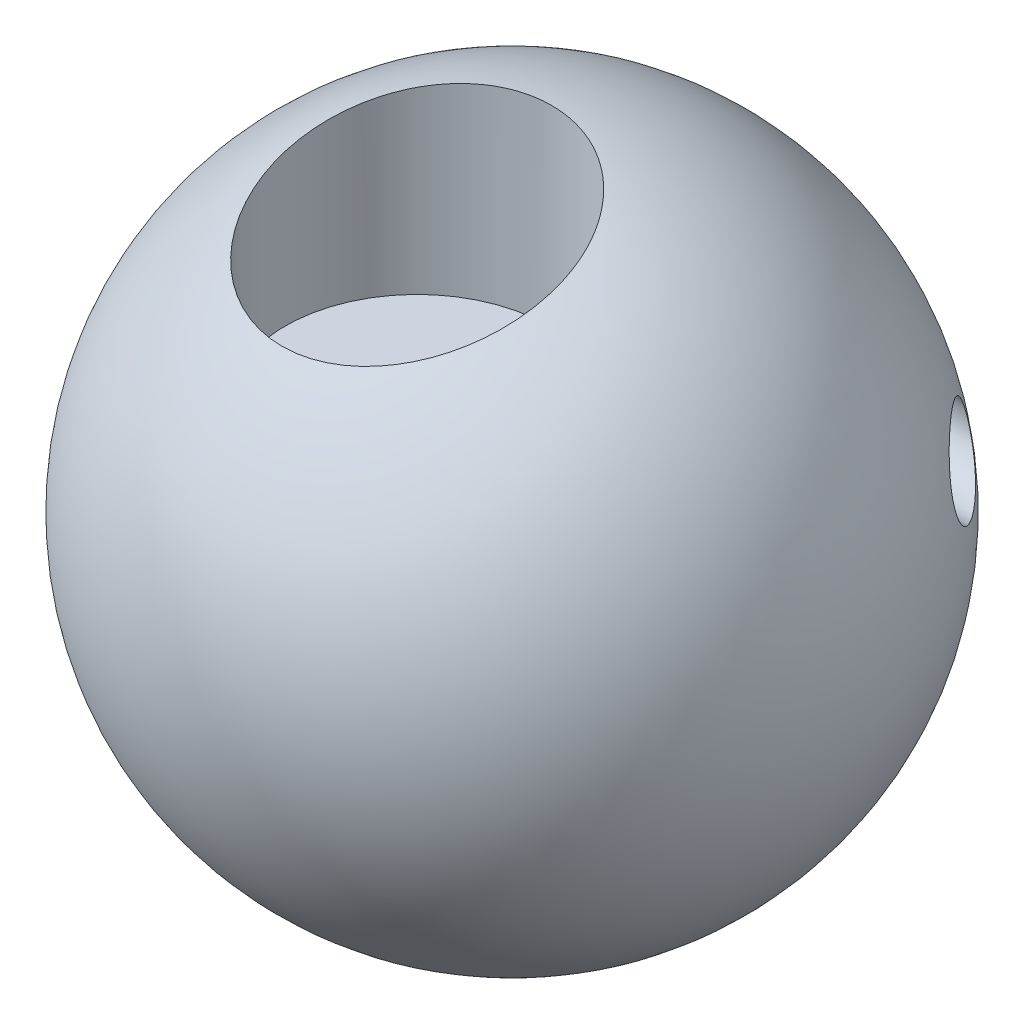
ISO-10303-21;
HEADER;
FILE_DESCRIPTION(('STEP AP214'),'2;1');
FILE_NAME('part.step','',(''),(''),'','','');
FILE_SCHEMA(('AUTOMOTIVE_DESIGN { 1 0 10303 214 1 1 1 1 }'));
ENDSEC;
DATA;
#1=APPLICATION_CONTEXT('core data for automotive mechanical design processes');
#2=APPLICATION_PROTOCOL_DEFINITION('international standard','automotive_design',2000,#1);
#3=PRODUCT_CONTEXT('',#1,'mechanical');
#4=PRODUCT('Part','Part','',(#3));
#5=PRODUCT_RELATED_PRODUCT_CATEGORY('part','',(#4));
#6=PRODUCT_DEFINITION_FORMATION('','',#4);
#7=PRODUCT_DEFINITION_CONTEXT('part definition',#1,'design');
#8=PRODUCT_DEFINITION('design','',#6,#7);
#9=PRODUCT_DEFINITION_SHAPE('','',#8);
#10=(LENGTH_UNIT() NAMED_UNIT(*) SI_UNIT(.MILLI.,.METRE.));
#11=(NAMED_UNIT(*) PLANE_ANGLE_UNIT() SI_UNIT($,.RADIAN.));
#12=(NAMED_UNIT(*) SI_UNIT($,.STERADIAN.) SOLID_ANGLE_UNIT());
#13=UNCERTAINTY_MEASURE_WITH_UNIT(LENGTH_MEASURE(1.E-05),#10,'distance_accuracy_value','');
#14=(GEOMETRIC_REPRESENTATION_CONTEXT(3) GLOBAL_UNCERTAINTY_ASSIGNED_CONTEXT((#13)) GLOBAL_UNIT_ASSIGNED_CONTEXT((#10,
#11,#12)) REPRESENTATION_CONTEXT('',''));
#15=CARTESIAN_POINT('',(0.,0.,0.));
#16=DIRECTION('',(0.,0.,1.));
#17=DIRECTION('',(1.,0.,0.));
#18=AXIS2_PLACEMENT_3D('',#15,#16,#17);
#19=CARTESIAN_POINT('',(0.,0.,0.));
#20=DIRECTION('',(0.,1.,0.));
#21=DIRECTION('',(0.,0.,1.));
#22=AXIS2_PLACEMENT_3D('',#19,#20,#21);
#23=TOROIDAL_SURFACE('',#22,72.1322546619376,9.84462162920429);
#24=CARTESIAN_POINT('',(0.,0.,81.9768762911419));
#25=VERTEX_POINT('',#24);
#26=VERTEX_LOOP('',#25);
#27=FACE_BOUND('',#26,.T.);
#28=ADVANCED_FACE('F43',(#27),#23,.T.);
#29=CLOSED_SHELL('',(#28));
#30=MANIFOLD_SOLID_BREP('B2',#29);
#31=CARTESIAN_POINT('',(0.,0.,0.));
#32=DIRECTION('',(0.,1.,0.));
#33=DIRECTION('',(1.,0.,0.));
#34=AXIS2_PLACEMENT_3D('',#31,#32,#33);
#35=SPHERICAL_SURFACE('',#34,100.);
#36=CARTESIAN_POINT('',(-76.7585668328231,4.82017874367396,-63.9131308468774));
#37=CARTESIAN_POINT('',(-77.0812542326004,4.72252799396046,-63.5329531939064));
#38=CARTESIAN_POINT('',(-77.4026196833159,4.6431210983936,-63.1469248083177));
#39=CARTESIAN_POINT('',(-78.0409807790761,4.52232743059165,-62.3651528120796));
#40=CARTESIAN_POINT('',(-78.3579747869562,4.48095454108507,-61.9694057080889));
#41=CARTESIAN_POINT('',(-78.9858586337921,4.4380383859875,-61.1702290564147));
#42=CARTESIAN_POINT('',(-79.2967415488923,4.43653795886195,-60.7667917119222));
#43=CARTESIAN_POINT('',(-79.9098202207956,4.47548974829651,-59.9553953610056));
#44=CARTESIAN_POINT('',(-80.2120179533117,4.51593234473524,-59.5474374126623));
#45=CARTESIAN_POINT('',(-80.7499644418729,4.62927073533002,-58.8063307602071));
#46=CARTESIAN_POINT('',(-80.9876032998101,4.69471605000407,-58.4734056384661));
#47=CARTESIAN_POINT('',(-81.4539887358628,4.85602427409244,-57.8086331129365));
#48=CARTESIAN_POINT('',(-81.6827355365148,4.95188642173106,-57.476785682368));
#49=CARTESIAN_POINT('',(-82.1292880901065,5.1750663078504,-56.8169838068717));
#50=CARTESIAN_POINT('',(-82.3471083370449,5.30234097487506,-56.489024670473));
#51=CARTESIAN_POINT('',(-82.7701648239548,5.58949632366565,-55.8393065027775));
#52=CARTESIAN_POINT('',(-82.9754034385343,5.74937082787029,-55.5175463094261));
#53=CARTESIAN_POINT('',(-83.3338228112824,6.06930337188106,-54.9431536783846));
#54=CARTESIAN_POINT('',(-83.4895289414374,6.2236582006722,-54.6889130988375));
#55=CARTESIAN_POINT('',(-83.7898914589301,6.55467953561914,-54.1885850136802));
#56=CARTESIAN_POINT('',(-83.93455008487,6.73134150223173,-53.9424958620656));
#57=CARTESIAN_POINT('',(-84.2114551823971,7.10706393976069,-53.4605741484614));
#58=CARTESIAN_POINT('',(-84.3437009908441,7.30612560610679,-53.2247421348079));
#59=CARTESIAN_POINT('',(-84.5943065205733,7.72638816754377,-52.7656968100389));
#60=CARTESIAN_POINT('',(-84.7126660000598,7.94758944801621,-52.5424837186852));
#61=CARTESIAN_POINT('',(-84.9349304397547,8.41343321648644,-52.1093675190535));
#62=CARTESIAN_POINT('',(-85.0387046906843,8.65825812895282,-51.8995929400164));
#63=CARTESIAN_POINT('',(-85.2290903626374,9.16857972366849,-51.4980947510638));
#64=CARTESIAN_POINT('',(-85.3157014202906,9.43407684341327,-51.3063715233672));
#65=CARTESIAN_POINT('',(-85.4702945392384,9.98375626437071,-50.9437695111752));
#66=CARTESIAN_POINT('',(-85.5382919670269,10.2679229111315,-50.7728735977416));
#67=CARTESIAN_POINT('',(-85.6545557621558,10.8527753363836,-50.4542225375767));
#68=CARTESIAN_POINT('',(-85.7028256594871,11.1534581485839,-50.3064632537611));
#69=CARTESIAN_POINT('',(-85.773368335255,11.7246710449301,-50.0554239194716));
#70=CARTESIAN_POINT('',(-85.7983622720361,11.9934068655407,-49.9488066537456));
#71=CARTESIAN_POINT('',(-85.8328795469118,12.5388085142815,-49.7551914619391));
#72=CARTESIAN_POINT('',(-85.8424045768517,12.8154734718278,-49.6681913912086));
#73=CARTESIAN_POINT('',(-85.845888866495,13.3744002837037,-49.5145712602885));
#74=CARTESIAN_POINT('',(-85.8398529908095,13.656660361526,-49.4479448382245));
#75=CARTESIAN_POINT('',(-85.8123671475474,14.2245369230569,-49.3354250150657));
#76=CARTESIAN_POINT('',(-85.7909173506711,14.5101533695612,-49.2895313843761));
#77=CARTESIAN_POINT('',(-85.7348186899926,15.0641874445222,-49.2207755880758));
#78=CARTESIAN_POINT('',(-85.7010972183411,15.3325422064348,-49.196632998778));
#79=CARTESIAN_POINT('',(-85.6209232865895,15.8683378797072,-49.166319234069));
#80=CARTESIAN_POINT('',(-85.5744715857874,16.1357788446078,-49.1601469870667));
#81=CARTESIAN_POINT('',(-85.4694195122994,16.6680434738668,-49.1653154321832));
#82=CARTESIAN_POINT('',(-85.4108205651903,16.9328674415333,-49.1766540702652));
#83=CARTESIAN_POINT('',(-85.2821142121608,17.4585131195855,-49.2162062409356));
#84=CARTESIAN_POINT('',(-85.2120024365936,17.7193332690782,-49.2444261915471));
#85=CARTESIAN_POINT('',(-85.056204966307,18.2519675724241,-49.3192758528517));
#86=CARTESIAN_POINT('',(-84.9698124166467,18.5234260944663,-49.3669621710898));
#87=CARTESIAN_POINT('',(-84.785721284316,19.0589287495074,-49.4795116269701));
#88=CARTESIAN_POINT('',(-84.6880186211544,19.3229701635823,-49.5443809748905));
#89=CARTESIAN_POINT('',(-84.4822340907378,19.842448323463,-49.6901674056054));
#90=CARTESIAN_POINT('',(-84.3741512138798,20.0978842290074,-49.7710860502079));
#91=CARTESIAN_POINT('',(-84.1484993070822,20.5992467783899,-49.947817820461));
#92=CARTESIAN_POINT('',(-84.0309289995845,20.8451721349392,-50.043632953658));
#93=CARTESIAN_POINT('',(-83.7683424693129,21.3639667950834,-50.2648664907342));
#94=CARTESIAN_POINT('',(-83.6218907267268,21.6351372562857,-50.3925714664217));
#95=CARTESIAN_POINT('',(-83.3187511789622,22.162993529281,-50.6645698934378));
#96=CARTESIAN_POINT('',(-83.1620623762108,22.4196779248913,-50.8088649624687));
#97=CARTESIAN_POINT('',(-82.6782620072172,23.167258901753,-51.2642890902127));
#98=CARTESIAN_POINT('',(-82.3373882626456,23.6357383771593,-51.5979811023742));
#99=CARTESIAN_POINT('',(-81.5543012577302,24.5995187257649,-52.3870792199402));
#100=CARTESIAN_POINT('',(-81.1056459924542,25.0805984419682,-52.8534104010666));
#101=CARTESIAN_POINT('',(-80.4104965678629,25.7326036170072,-53.5924189464678));
#102=CARTESIAN_POINT('',(-80.1749460822205,25.938433015958,-53.8454948507388));
#103=CARTESIAN_POINT('',(-79.6975437852534,26.3269790540179,-54.3631632351158));
#104=CARTESIAN_POINT('',(-79.4556916993139,26.5096946838236,-54.6277562174575));
#105=CARTESIAN_POINT('',(-78.6194372946881,27.0951866123555,-55.5498013216608));
#106=CARTESIAN_POINT('',(-78.0118016829368,27.4422738338175,-56.2318911508049));
#107=CARTESIAN_POINT('',(-77.0882381734649,27.8615708941092,-57.283289207045));
#108=CARTESIAN_POINT('',(-76.7781043559441,27.9845071238218,-57.6387708566343));
#109=CARTESIAN_POINT('',(-76.155047551259,28.1966200979121,-58.3574876683824));
#110=CARTESIAN_POINT('',(-75.8421244833,28.2857958610939,-58.7207230555675));
#111=CARTESIAN_POINT('',(-75.1672684764483,28.4411323622851,-59.5088181821777));
#112=CARTESIAN_POINT('',(-74.8051462187487,28.5017015596874,-59.9346204446197));
#113=CARTESIAN_POINT('',(-74.0817621232985,28.5770185662413,-60.7911358509791));
#114=CARTESIAN_POINT('',(-73.7205004603245,28.5917577487603,-61.221849904136));
#115=CARTESIAN_POINT('',(-73.0016390526694,28.5743639297146,-62.0852800964568));
#116=CARTESIAN_POINT('',(-72.6440386033388,28.5422401250732,-62.5179958261771));
#117=CARTESIAN_POINT('',(-71.9355551023576,28.4296662037763,-63.3825322633033));
#118=CARTESIAN_POINT('',(-71.5846700291577,28.3492308743342,-63.8143532040207));
#119=CARTESIAN_POINT('',(-70.9747514078851,28.162940841409,-64.5725753392733));
#120=CARTESIAN_POINT('',(-70.7135718643403,28.0675547789697,-64.8998208104214));
#121=CARTESIAN_POINT('',(-70.1992980198895,27.8463775589844,-65.5501514835018));
#122=CARTESIAN_POINT('',(-69.9462035186379,27.7205871555142,-65.8732367884035));
#123=CARTESIAN_POINT('',(-69.2028115170444,27.295797688298,-66.832938911417));
#124=CARTESIAN_POINT('',(-68.7271671897152,26.9490206791703,-67.461533090427));
#125=CARTESIAN_POINT('',(-68.1201734031358,26.3794633170054,-68.2925237342461));
#126=CARTESIAN_POINT('',(-67.9598688871568,26.2151766840702,-68.5151305935303));
#127=CARTESIAN_POINT('',(-67.6501174058986,25.8670141838847,-68.952600209111));
#128=CARTESIAN_POINT('',(-67.5006697148765,25.6831396280528,-69.167463482556));
#129=CARTESIAN_POINT('',(-67.2147169034017,25.2957383540047,-69.5874233069121));
#130=CARTESIAN_POINT('',(-67.0781991083359,25.0922312842147,-69.7925293221573));
#131=CARTESIAN_POINT('',(-66.8200406854289,24.6653895466919,-70.1911859786162));
#132=CARTESIAN_POINT('',(-66.6983973180206,24.442058543242,-70.3847387443323));
#133=CARTESIAN_POINT('',(-66.4927330974059,24.0182380896977,-70.7241757929932));
#134=CARTESIAN_POINT('',(-66.4058889985173,23.820942328547,-70.8723426586465));
#135=CARTESIAN_POINT('',(-66.2449395283875,23.4138691335224,-71.1580423908134));
#136=CARTESIAN_POINT('',(-66.1708315485555,23.2040942674751,-71.2955774317372));
#137=CARTESIAN_POINT('',(-66.0365812197284,22.7729565317634,-71.5585817996114));
#138=CARTESIAN_POINT('',(-65.976432249219,22.5515992175999,-71.6840568306618));
#139=CARTESIAN_POINT('',(-65.8711355741705,22.0983675519228,-71.9216510174197));
#140=CARTESIAN_POINT('',(-65.8259880130526,21.8664930998841,-72.0337700454304));
#141=CARTESIAN_POINT('',(-65.7513777090183,21.3925765825402,-72.2439126414532));
#142=CARTESIAN_POINT('',(-65.7219936334193,21.1504899074931,-72.3418637639783));
#143=CARTESIAN_POINT('',(-65.6798251104961,20.6590830570198,-72.5219399943644));
#144=CARTESIAN_POINT('',(-65.667040668435,20.4097628793002,-72.6040650972075));
#145=CARTESIAN_POINT('',(-65.6582752189621,19.9059845693094,-72.7517119284591));
#146=CARTESIAN_POINT('',(-65.6622931156871,19.6515267731955,-72.8172347393879));
#147=CARTESIAN_POINT('',(-65.6869449539192,19.1396344038332,-72.9312591571066));
#148=CARTESIAN_POINT('',(-65.7075783416269,18.8821999300803,-72.9797613311222));
#149=CARTESIAN_POINT('',(-65.7627074121691,18.3862652799633,-73.0566240911317));
#150=CARTESIAN_POINT('',(-65.7960199008506,18.1478255795847,-73.0862431384538));
#151=CARTESIAN_POINT('',(-65.8756703507454,17.671806753951,-73.1311290366131));
#152=CARTESIAN_POINT('',(-65.9220072168645,17.4342275580447,-73.1463970936179));
#153=CARTESIAN_POINT('',(-66.0268990436383,16.9612498340571,-73.1629917768339));
#154=CARTESIAN_POINT('',(-66.0854568708974,16.7258518311604,-73.1643151283548));
#155=CARTESIAN_POINT('',(-66.2138673365231,16.2584517281325,-73.1535735011213));
#156=CARTESIAN_POINT('',(-66.2837222293535,16.0264503159303,-73.1415058472091));
#157=CARTESIAN_POINT('',(-66.4601131408391,15.4861372620136,-73.0981543528422));
#158=CARTESIAN_POINT('',(-66.5709174206089,15.1796278876627,-73.0616118378053));
#159=CARTESIAN_POINT('',(-66.8090193877431,14.5764952008048,-72.9670346524949));
#160=CARTESIAN_POINT('',(-66.9363217250496,14.2798747052027,-72.9089939143915));
#161=CARTESIAN_POINT('',(-67.2053630969083,13.6974300659152,-72.7731217040035));
#162=CARTESIAN_POINT('',(-67.3471227954234,13.4116221992631,-72.6952616594098));
#163=CARTESIAN_POINT('',(-67.6428807866573,12.8521315486086,-72.5215217094197));
#164=CARTESIAN_POINT('',(-67.7968796357287,12.5784493166806,-72.42564098459));
#165=CARTESIAN_POINT('',(-68.1701219553291,11.9517222218426,-72.1816128478119));
#166=CARTESIAN_POINT('',(-68.3935870049171,11.6037602991542,-72.026831487961));
#167=CARTESIAN_POINT('',(-68.8556946796125,10.9313714285687,-71.6909562600886));
#168=CARTESIAN_POINT('',(-69.0943431407087,10.6069536340549,-71.5098522397525));
#169=CARTESIAN_POINT('',(-69.5840770699248,9.98160237432922,-71.1239695898912));
#170=CARTESIAN_POINT('',(-69.8351806724344,9.68070489860128,-70.9191558246794));
#171=CARTESIAN_POINT('',(-70.346931930887,9.10311677697844,-70.4885644360653));
#172=CARTESIAN_POINT('',(-70.6075794589955,8.82642580702184,-70.2627870933939));
#173=CARTESIAN_POINT('',(-71.2050967351629,8.22850787017006,-69.7311672700692));
#174=CARTESIAN_POINT('',(-71.5441672375287,7.91440124740556,-69.4197686708724));
#175=CARTESIAN_POINT('',(-72.2307035194803,7.32495840136781,-68.770493129375));
#176=CARTESIAN_POINT('',(-72.5781721172439,7.04963541057078,-68.4326072108479));
#177=CARTESIAN_POINT('',(-73.2778996684971,6.53878853702663,-67.7340592634472));
#178=CARTESIAN_POINT('',(-73.6301496521659,6.30319895192269,-67.3734362165092));
#179=CARTESIAN_POINT('',(-74.3372980399691,5.87214973154432,-66.6317700555522));
#180=CARTESIAN_POINT('',(-74.6921951134538,5.67667117904373,-66.2507366749075));
#181=CARTESIAN_POINT('',(-75.3329935394227,5.36103944695674,-65.5469244396308));
#182=CARTESIAN_POINT('',(-75.6188254393369,5.23363130020284,-65.2273120324846));
#183=CARTESIAN_POINT('',(-76.1896351009923,5.00616444656388,-64.5776874531197));
#184=CARTESIAN_POINT('',(-76.4746127864146,4.90610811536651,-64.2476743803084));
#185=CARTESIAN_POINT('',(-76.7585668328231,4.82017874367396,-63.9131308468774));
#186=B_SPLINE_CURVE_WITH_KNOTS('',3,(#36,#37,#38,#39,#40,#41,#42,#43,#44,#45,#46,#47,#48,#49,
#50,#51,#52,#53,#54,#55,#56,#57,#58,#59,#60,#61,#62,#63,#64,#65,#66,#67,#68,#69,#70,#71,#72,#73,
#74,#75,#76,#77,#78,#79,#80,#81,#82,#83,#84,#85,#86,#87,#88,#89,#90,#91,#92,#93,#94,#95,#96,#97,
#98,#99,#100,#101,#102,#103,#104,#105,#106,#107,#108,#109,#110,#111,#112,#113,#114,#115,#116,
#117,#118,#119,#120,#121,#122,#123,#124,#125,#126,#127,#128,#129,#130,#131,#132,#133,#134,#135,
#136,#137,#138,#139,#140,#141,#142,#143,#144,#145,#146,#147,#148,#149,#150,#151,#152,#153,#154,
#155,#156,#157,#158,#159,#160,#161,#162,#163,#164,#165,#166,#167,#168,#169,#170,#171,#172,#173,
#174,#175,#176,#177,#178,#179,#180,#181,#182,#183,#184,#185),.UNSPECIFIED.,.T.,.F.,(4,2,2,2,2,2,
2,2,2,2,2,2,2,2,2,2,2,2,2,2,2,2,2,2,2,2,2,2,2,2,2,2,2,2,2,2,2,2,2,2,2,2,2,2,2,2,2,2,2,2,2,2,2,2,
2,2,2,2,2,2,2,2,2,2,2,2,2,2,2,2,2,2,2,2,4),(0.,1.52406785218018,3.04869178117787,
4.57495368054606,6.10086559135968,7.3424750794421,8.58405347443541,9.82393883880847,
11.0635894669911,12.0698139116127,13.0758339167455,14.0819076367551,15.087998872414,
16.1025987585208,17.1172201229151,18.1310013224093,19.1446010391302,20.0140316854913,
20.8833672352037,21.7524310483861,22.6214852373304,23.4352038604994,24.2488739597511,
25.0624486222858,25.8763327905185,26.7419742462225,27.6079289893324,28.4739680426246,
29.3401239102187,30.3399485419026,31.3398707494431,33.3395177490203,35.7494756790262,
36.955820813065,38.1622186061194,41.0806811739557,42.5423270359063,44.0040153750773,
45.6888397891482,47.3739813203209,49.0587921847253,50.743087624066,52.0301619590917,
53.3172043759157,55.8853381697746,56.8439832319042,57.8025641526917,58.760195476383,
59.7176501573356,60.5016164677577,61.2854220156295,62.0688549986183,62.8522954714159,
63.6396101494872,64.4269250771908,65.2141886563324,66.0014259968251,66.7283482536205,
67.455209408815,68.1822412518861,68.9094183622541,69.891871195599,70.8746015358296,
71.8587567236272,72.8429566735956,74.1656963294789,75.48894750965,76.8141853546912,
78.1394054555539,79.8091213284471,81.4794055142034,83.1469000807237,84.8136064041671,
86.1546183574531,87.4957467495943),.UNSPECIFIED.);
#187=CARTESIAN_POINT('',(-76.7585668328231,4.82017874367396,-63.9131308468774));
#188=VERTEX_POINT('',#187);
#189=EDGE_CURVE('E60',#188,#188,#186,.T.);
#190=ORIENTED_EDGE('',*,*,#189,.F.);
#191=EDGE_LOOP('',(#190));
#192=FACE_BOUND('',#191,.T.);
#193=CARTESIAN_POINT('',(69.3877339714843,13.0392245945661,-70.8189310585453));
#194=CARTESIAN_POINT('',(69.1432059648702,13.2943008187297,-71.0115522294163));
#195=CARTESIAN_POINT('',(68.9023261734755,13.5595797404078,-71.1952868308591));
#196=CARTESIAN_POINT('',(68.4298349835271,14.1105040076862,-71.5430891493295));
#197=CARTESIAN_POINT('',(68.1982256578242,14.3961538688934,-71.7071524840998));
#198=CARTESIAN_POINT('',(67.5208369980019,15.2834486128553,-72.1664623455433));
#199=CARTESIAN_POINT('',(67.0918937762455,15.9160567291068,-72.4293058461464));
#200=CARTESIAN_POINT('',(66.4046864145681,17.0877216643591,-72.7927825203851));
#201=CARTESIAN_POINT('',(66.1306993071857,17.6099415832525,-72.9176322020113));
#202=CARTESIAN_POINT('',(65.7598744093755,18.4200274591864,-73.0508846523758));
#203=CARTESIAN_POINT('',(65.6429857375568,18.6944351775415,-73.0862961064525));
#204=CARTESIAN_POINT('',(65.4243741278366,19.2510536229981,-73.1378026517171));
#205=CARTESIAN_POINT('',(65.3226488537148,19.5332631401198,-73.1539007212122));
#206=CARTESIAN_POINT('',(65.1508005499438,20.0593198454932,-73.1646166912538));
#207=CARTESIAN_POINT('',(65.0782231137023,20.3023086778544,-73.162185436488));
#208=CARTESIAN_POINT('',(64.9463815573728,20.7912336557076,-73.1420283054458));
#209=CARTESIAN_POINT('',(64.8871149812342,21.0371692486428,-73.1243052536591));
#210=CARTESIAN_POINT('',(64.7829055141362,21.5303573512712,-73.0731347509552));
#211=CARTESIAN_POINT('',(64.7379573144162,21.7776093382401,-73.0396931393497));
#212=CARTESIAN_POINT('',(64.6631618705057,22.2717519451857,-72.95689628734));
#213=CARTESIAN_POINT('',(64.6333147873929,22.5186425612797,-72.9075408771988));
#214=CARTESIAN_POINT('',(64.5892011092888,23.0108771669131,-72.7928510893505));
#215=CARTESIAN_POINT('',(64.5749807779336,23.2562144374359,-72.7274699619341));
#216=CARTESIAN_POINT('',(64.5625028087767,23.7426447853354,-72.5812275226514));
#217=CARTESIAN_POINT('',(64.5642451870024,23.9837378584505,-72.5003661952422));
#218=CARTESIAN_POINT('',(64.5835715405626,24.459832278463,-72.323878829183));
#219=CARTESIAN_POINT('',(64.6011575113472,24.694832854194,-72.2282509319875));
#220=CARTESIAN_POINT('',(64.6517219342962,25.1570220909628,-72.0232160052675));
#221=CARTESIAN_POINT('',(64.6847003373392,25.3842107769279,-71.9138090197167));
#222=CARTESIAN_POINT('',(64.7636065087134,25.8199150706345,-71.6872824317063));
#223=CARTESIAN_POINT('',(64.808926712133,26.0288140147921,-71.5706856951725));
#224=CARTESIAN_POINT('',(64.912205190981,26.4372298256232,-71.326977622089));
#225=CARTESIAN_POINT('',(64.9701682510659,26.6367431054708,-71.1998623161478));
#226=CARTESIAN_POINT('',(65.0977882200129,27.0255679626111,-70.9362804142544));
#227=CARTESIAN_POINT('',(65.1674450728388,27.214879588784,-70.7998138631148));
#228=CARTESIAN_POINT('',(65.3174720977267,27.5828339205241,-70.518610219378));
#229=CARTESIAN_POINT('',(65.3978444851561,27.7614744088137,-70.3738714200916));
#230=CARTESIAN_POINT('',(65.6037425030733,28.1797464823513,-70.0154950205547));
#231=CARTESIAN_POINT('',(65.7341537484504,28.4138791336066,-69.7982178262697));
#232=CARTESIAN_POINT('',(66.0117595144099,28.8598512789022,-69.3518240106919));
#233=CARTESIAN_POINT('',(66.1589595709981,29.0716833749378,-69.1227034978354));
#234=CARTESIAN_POINT('',(66.4679344831151,29.4735487351483,-68.6545180273879));
#235=CARTESIAN_POINT('',(66.6297351138268,29.663542047021,-68.4154359008016));
#236=CARTESIAN_POINT('',(66.9654802158133,30.0217199687633,-67.9296701321748));
#237=CARTESIAN_POINT('',(67.1394250150214,30.1899039893583,-67.6829862849631));
#238=CARTESIAN_POINT('',(67.5594769993046,30.5595390160854,-67.097298483335));
#239=CARTESIAN_POINT('',(67.8097508661271,30.7524048542961,-66.7558472282853));
#240=CARTESIAN_POINT('',(68.3250009797696,31.1012852457703,-66.0652744390007));
#241=CARTESIAN_POINT('',(68.5899822120233,31.2572872077123,-65.7161503283807));
#242=CARTESIAN_POINT('',(69.1315637683581,31.5339243687686,-65.0127275890943));
#243=CARTESIAN_POINT('',(69.4081693752696,31.6545432845225,-64.6584266565337));
#244=CARTESIAN_POINT('',(69.9702485455946,31.8615952797005,-63.9470038655982));
#245=CARTESIAN_POINT('',(70.2557213486658,31.9480312815536,-63.589882251038));
#246=CARTESIAN_POINT('',(70.840015768933,32.0894073207538,-62.8664324904179));
#247=CARTESIAN_POINT('',(71.1389933781611,32.1435795684547,-62.5000810361488));
#248=CARTESIAN_POINT('',(71.741993915853,32.2181835412579,-61.7681245487881));
#249=CARTESIAN_POINT('',(72.0460169035741,32.2386148697931,-61.4025195245201));
#250=CARTESIAN_POINT('',(72.6574328888537,32.2463937420349,-60.6736668613084));
#251=CARTESIAN_POINT('',(72.9648265642854,32.2337345047699,-60.3104197208371));
#252=CARTESIAN_POINT('',(73.581353639337,32.1757605311535,-59.5880123663034));
#253=CARTESIAN_POINT('',(73.8904871699946,32.1304433015963,-59.2288524663994));
#254=CARTESIAN_POINT('',(74.5686833922662,31.9955282769168,-58.4475803333323));
#255=CARTESIAN_POINT('',(74.9378065429598,31.899076438169,-58.0266851197916));
#256=CARTESIAN_POINT('',(75.6740035974782,31.6601727785703,-57.1961619430273));
#257=CARTESIAN_POINT('',(76.0410771057273,31.5177123704694,-56.7865360986706));
#258=CARTESIAN_POINT('',(76.7705682620248,31.1866995308929,-55.9820666598723));
#259=CARTESIAN_POINT('',(77.1329864770151,30.9981527691183,-55.5872212539754));
#260=CARTESIAN_POINT('',(77.8504661296115,30.5747195234126,-54.8161791275723));
#261=CARTESIAN_POINT('',(78.2055291614365,30.3398431999317,-54.4399783407441));
#262=CARTESIAN_POINT('',(78.8307089160037,29.8785150493678,-53.7884094579087));
#263=CARTESIAN_POINT('',(79.1027982525192,29.6609416142572,-53.5086426942946));
#264=CARTESIAN_POINT('',(79.6388534172457,29.1969424276199,-52.9659435281556));
#265=CARTESIAN_POINT('',(79.902819665177,28.9505181699878,-52.7030102550827));
#266=CARTESIAN_POINT('',(80.6792445754754,28.1684296866356,-51.9441229510383));
#267=CARTESIAN_POINT('',(81.1774094331248,27.589090917912,-51.4768445501976));
#268=CARTESIAN_POINT('',(82.0219877354879,26.4456457799101,-50.7299829654972));
#269=CARTESIAN_POINT('',(82.3788322907283,25.9016326201495,-50.4315520083621));
#270=CARTESIAN_POINT('',(82.8771442790043,25.0370399996688,-50.0465077623086));
#271=CARTESIAN_POINT('',(83.0370845969888,24.740757261174,-49.9285961566316));
#272=CARTESIAN_POINT('',(83.3430848046576,24.1330884087374,-49.7157034262426));
#273=CARTESIAN_POINT('',(83.4891467085895,23.8217044964476,-49.6207189709001));
#274=CARTESIAN_POINT('',(83.7437393456205,23.2358605109708,-49.4688896911231));
#275=CARTESIAN_POINT('',(83.854554505941,22.9633342106118,-49.4083907446342));
#276=CARTESIAN_POINT('',(84.0639621010254,22.4101588124802,-49.3064405191241));
#277=CARTESIAN_POINT('',(84.1625567503919,22.1295111978571,-49.2649857852121));
#278=CARTESIAN_POINT('',(84.3464286388241,21.561720148272,-49.2022582443053));
#279=CARTESIAN_POINT('',(84.4317088599588,21.2745781844092,-49.18098091269));
#280=CARTESIAN_POINT('',(84.5879422096486,20.695614961,-49.1595521327085));
#281=CARTESIAN_POINT('',(84.6588951326484,20.4037936343831,-49.1594009874208));
#282=CARTESIAN_POINT('',(84.7858634823237,19.8161027677537,-49.1809961733035));
#283=CARTESIAN_POINT('',(84.8417990955351,19.5202200537231,-49.2028566826489));
#284=CARTESIAN_POINT('',(84.9374488080351,18.9283258441101,-49.2690494614432));
#285=CARTESIAN_POINT('',(84.977162783659,18.6323143475633,-49.3133819021999));
#286=CARTESIAN_POINT('',(85.0397801278812,18.0428241606774,-49.4245203361099));
#287=CARTESIAN_POINT('',(85.0626884092333,17.7493447549519,-49.4913197532308));
#288=CARTESIAN_POINT('',(85.0913892875967,17.1674609909389,-49.6470003842153));
#289=CARTESIAN_POINT('',(85.0971832048271,16.8790562428936,-49.7358798942248));
#290=CARTESIAN_POINT('',(85.0918746952672,16.3356432790539,-49.9258933571374));
#291=CARTESIAN_POINT('',(85.0822538936936,16.0799747362768,-50.0251904095985));
#292=CARTESIAN_POINT('',(85.0490046397199,15.5767341142446,-50.2404949199066));
#293=CARTESIAN_POINT('',(85.0253771891077,15.329161457289,-50.356501182223));
#294=CARTESIAN_POINT('',(84.9644683180977,14.8437275860686,-50.6041307057233));
#295=CARTESIAN_POINT('',(84.9271876120737,14.605865864426,-50.7357531495847));
#296=CARTESIAN_POINT('',(84.8394781650795,14.1412192931502,-51.0133711014727));
#297=CARTESIAN_POINT('',(84.7890489909617,13.9144348087246,-51.1593670829056));
#298=CARTESIAN_POINT('',(84.6750529677062,13.4706803569753,-51.4660372948813));
#299=CARTESIAN_POINT('',(84.6113485618527,13.2538447384711,-51.6268545043534));
#300=CARTESIAN_POINT('',(84.4718906833134,12.8335927159876,-51.9603252691311));
#301=CARTESIAN_POINT('',(84.3961372639426,12.6301762526361,-52.1329787720609));
#302=CARTESIAN_POINT('',(84.2333815638747,12.2374326443235,-52.4886605196646));
#303=CARTESIAN_POINT('',(84.146379466987,12.0481052692189,-52.6716885947849));
#304=CARTESIAN_POINT('',(83.9619201184605,11.6839170139028,-53.0467616817139));
#305=CARTESIAN_POINT('',(83.8644590787301,11.5090614160679,-53.2388099462587));
#306=CARTESIAN_POINT('',(83.647828386583,11.1543217834996,-53.6536859658124));
#307=CARTESIAN_POINT('',(83.527454509719,10.9762885641135,-53.8774678069191));
#308=CARTESIAN_POINT('',(83.2757715140381,10.6387626358759,-54.3328521710005));
#309=CARTESIAN_POINT('',(83.1444579549344,10.4792775190263,-54.564457846678));
#310=CARTESIAN_POINT('',(82.8719451954629,10.1787653282482,-55.0338959308164));
#311=CARTESIAN_POINT('',(82.7307418642068,10.0377460387923,-55.2717309149352));
#312=CARTESIAN_POINT('',(82.439488848893,9.77398618171074,-55.7520960440731));
#313=CARTESIAN_POINT('',(82.2894374864018,9.65124909781233,-55.9946270740134));
#314=CARTESIAN_POINT('',(81.9120760026798,9.37250728244282,-56.5930236873482));
#315=CARTESIAN_POINT('',(81.6803880561523,9.2263906638989,-56.9507714473921));
#316=CARTESIAN_POINT('',(81.2029115788107,8.97061444690161,-57.6699060289652));
#317=CARTESIAN_POINT('',(80.9571181210662,8.86096767904677,-58.0312940852296));
#318=CARTESIAN_POINT('',(80.4534377776355,8.67663850142391,-58.7551127186536));
#319=CARTESIAN_POINT('',(80.1955388217851,8.60199184081713,-59.1175439829483));
#320=CARTESIAN_POINT('',(79.6699792783905,8.48637731182111,-59.8404476032298));
#321=CARTESIAN_POINT('',(79.4023194939522,8.44540667911991,-60.2009201175879));
#322=CARTESIAN_POINT('',(78.5804774867841,8.37030446965731,-61.2852051241045));
#323=CARTESIAN_POINT('',(78.0133422494131,8.38606207377562,-62.0034039643318));
#324=CARTESIAN_POINT('',(77.1476376295455,8.50103328546294,-63.0569886896128));
#325=CARTESIAN_POINT('',(76.8563856871537,8.55464051271914,-63.404437373454));
#326=CARTESIAN_POINT('',(76.2700419094196,8.69129169665814,-64.0901703319002));
#327=CARTESIAN_POINT('',(75.9749511266151,8.77432774181067,-64.4284570432903));
#328=CARTESIAN_POINT('',(75.3236261309693,8.98817837471288,-65.1602850116746));
#329=CARTESIAN_POINT('',(74.966838906183,9.12519365171382,-65.5515261705324));
#330=CARTESIAN_POINT('',(74.2517799749873,9.4389201311828,-66.3165042942863));
#331=CARTESIAN_POINT('',(73.8935079434635,9.61564053327819,-66.6902371782457));
#332=CARTESIAN_POINT('',(73.1783585830347,10.0075475818223,-67.4171696463852));
#333=CARTESIAN_POINT('',(72.8214799864039,10.2226782254252,-67.7703981458369));
#334=CARTESIAN_POINT('',(72.1112127604661,10.690861596647,-68.4541900360969));
#335=CARTESIAN_POINT('',(71.7578226666586,10.9438976208177,-68.7847633171386));
#336=CARTESIAN_POINT('',(71.0628695787611,11.4832030379635,-69.4153636756908));
#337=CARTESIAN_POINT('',(70.721207711194,11.7688655497371,-69.7157998473349));
#338=CARTESIAN_POINT('',(70.0467742235635,12.3766948580341,-70.2890828343737));
#339=CARTESIAN_POINT('',(69.7140065582463,12.6988775699791,-70.5619175223233));
#340=CARTESIAN_POINT('',(69.3877339714843,13.0392245945661,-70.8189310585453));
#341=B_SPLINE_CURVE_WITH_KNOTS('',3,(#193,#194,#195,#196,#197,#198,#199,#200,#201,#202,#203,
#204,#205,#206,#207,#208,#209,#210,#211,#212,#213,#214,#215,#216,#217,#218,#219,#220,#221,#222,
#223,#224,#225,#226,#227,#228,#229,#230,#231,#232,#233,#234,#235,#236,#237,#238,#239,#240,#241,
#242,#243,#244,#245,#246,#247,#248,#249,#250,#251,#252,#253,#254,#255,#256,#257,#258,#259,#260,
#261,#262,#263,#264,#265,#266,#267,#268,#269,#270,#271,#272,#273,#274,#275,#276,#277,#278,#279,
#280,#281,#282,#283,#284,#285,#286,#287,#288,#289,#290,#291,#292,#293,#294,#295,#296,#297,#298,
#299,#300,#301,#302,#303,#304,#305,#306,#307,#308,#309,#310,#311,#312,#313,#314,#315,#316,#317,
#318,#319,#320,#321,#322,#323,#324,#325,#326,#327,#328,#329,#330,#331,#332,#333,#334,#335,#336,
#337,#338,#339,#340),.UNSPECIFIED.,.T.,.F.,(4,2,2,2,2,2,2,2,2,2,2,2,2,2,2,2,2,2,2,2,2,2,2,2,2,2,
2,2,2,2,2,2,2,2,2,2,2,2,2,2,2,2,2,2,2,2,2,2,2,2,2,2,2,2,2,2,2,2,2,2,2,2,2,2,2,2,2,2,2,2,2,2,2,
4),(0.,1.20697288000176,2.41421414519856,4.82576607716689,6.62705950720071,7.52720438249773,
8.42721042906731,9.18726915421607,9.94718752185798,10.7068238091288,11.466468198973,
12.2283555382078,12.9902436424198,13.7522277174359,14.514209360771,15.2439205111523,
15.9739082994759,16.7038925898292,17.4340280344273,18.467536394356,19.5013865379,
20.5370988979061,21.5728392364401,22.9664621083782,24.3605603039397,25.7552990638587,
27.1499185564012,28.5765221971068,30.0031426049883,31.4300553811149,32.8570771034381,
34.5592965143154,36.2618338190055,37.9641617770519,39.666116814967,41.0052452874188,
42.3443044504807,45.0167454154383,47.1551163354071,48.2242332160853,49.2931946924027,
50.1933585243062,51.0933589891512,51.9931575883562,52.8929690961617,53.7974722467981,
54.7019822927316,55.606227820716,56.5104035924662,57.3327537553808,58.1550451089998,
58.9772934443492,59.7995688703025,60.6308308405035,61.4620891325994,62.2933338432074,
63.1248806423574,64.0547672644642,64.9850331727001,65.9156899908239,66.846523922059,
68.1962849054524,69.546520252409,70.8981317434929,72.2496322758538,74.9839544214314,
76.3527974340439,77.7212727309553,79.3603284948691,80.9997644182865,82.6368292484163,
84.273174797413,85.8829288773555,87.493387201384),.UNSPECIFIED.);
#342=CARTESIAN_POINT('',(69.3877339714843,13.0392245945661,-70.8189310585453));
#343=VERTEX_POINT('',#342);
#344=EDGE_CURVE('E77',#343,#343,#341,.T.);
#345=ORIENTED_EDGE('',*,*,#344,.F.);
#346=EDGE_LOOP('',(#345));
#347=FACE_BOUND('',#346,.T.);
#348=CARTESIAN_POINT('',(-32.3830651394079,94.6106608616789,-0.399929360318711));
#349=CARTESIAN_POINT('',(-31.6484898693131,94.8586068919636,-1.2231163236754));
#350=CARTESIAN_POINT('',(-30.8785275355345,95.0985040196887,-2.01736783511646));
#351=CARTESIAN_POINT('',(-29.2725197140086,95.5607401113787,-3.54178159135165));
#352=CARTESIAN_POINT('',(-28.4364629080942,95.7830760550382,-4.27193281409045));
#353=CARTESIAN_POINT('',(-26.702875064635,96.2089912006718,-5.6628303610567));
#354=CARTESIAN_POINT('',(-25.8052978085065,96.4125560251036,-6.32352353799325));
#355=CARTESIAN_POINT('',(-23.955119798305,96.7994701867778,-7.5694159173198));
#356=CARTESIAN_POINT('',(-23.0025215093706,96.9828204286366,-8.15461849816508));
#357=CARTESIAN_POINT('',(-21.0476916461981,97.3283375299546,-9.24516928692234));
#358=CARTESIAN_POINT('',(-20.0454113770106,97.4904830162413,-9.75043703104627));
#359=CARTESIAN_POINT('',(-17.9990659550323,97.7923336164436,-10.6759985997013));
#360=CARTESIAN_POINT('',(-16.9550001836488,97.9320383979934,-11.0962911657018));
#361=CARTESIAN_POINT('',(-14.8328242092969,98.1880598512669,-11.8480171291138));
#362=CARTESIAN_POINT('',(-13.7547216662283,98.3043817424542,-12.1794703625123));
#363=CARTESIAN_POINT('',(-11.5721862965373,98.512898750706,-12.7505483372701));
#364=CARTESIAN_POINT('',(-10.4677540556183,98.6050944039126,-12.9901751192856));
#365=CARTESIAN_POINT('',(-8.26580742904155,98.7629476882267,-13.370975783008));
#366=CARTESIAN_POINT('',(-7.16869278514396,98.8291537960783,-13.5142358907836));
#367=CARTESIAN_POINT('',(-4.96518769533131,98.9374832488853,-13.7093975265995));
#368=CARTESIAN_POINT('',(-3.858797374327,98.9796069176196,-13.7613002829228));
#369=CARTESIAN_POINT('',(-1.64494365989079,99.0394921856506,-13.7731367906991));
#370=CARTESIAN_POINT('',(-0.537480348322362,99.0572555163821,-13.7330770790162));
#371=CARTESIAN_POINT('',(1.67042289962503,99.0683079636529,-13.5611995544122));
#372=CARTESIAN_POINT('',(2.77086289530533,99.0615972871127,-13.4293825172806));
#373=CARTESIAN_POINT('',(4.93828085232615,99.0240645861383,-13.0779750524453));
#374=CARTESIAN_POINT('',(6.00551056467394,98.9936482800077,-12.8598917000578));
#375=CARTESIAN_POINT('',(8.1177556072271,98.9093939375682,-12.337712029197));
#376=CARTESIAN_POINT('',(9.16277124532439,98.8555562261073,-12.0336169037025));
#377=CARTESIAN_POINT('',(11.2232378034236,98.7248026268273,-11.3418495218075));
#378=CARTESIAN_POINT('',(12.2386894933176,98.6478873405755,-10.954179444045));
#379=CARTESIAN_POINT('',(14.2330520337276,98.4714613699761,-10.0983563767361));
#380=CARTESIAN_POINT('',(15.2119626294094,98.3719505280834,-9.63020282603316));
#381=CARTESIAN_POINT('',(17.1295605591064,98.1506116266202,-8.61557622541087));
#382=CARTESIAN_POINT('',(18.0681150323122,98.0287159210003,-8.0688669033833));
#383=CARTESIAN_POINT('',(19.8955642108477,97.7635624080653,-6.9025326659921));
#384=CARTESIAN_POINT('',(20.7844589916452,97.6203046332153,-6.28290786144236));
#385=CARTESIAN_POINT('',(22.5069194697475,97.3132851645895,-4.97551651572422));
#386=CARTESIAN_POINT('',(23.3404824586527,97.1495224682626,-4.28774664306902));
#387=CARTESIAN_POINT('',(24.947066707269,96.8024689949829,-2.84931178528893));
#388=CARTESIAN_POINT('',(25.7200870047466,96.6191779077655,-2.09864580091896));
#389=CARTESIAN_POINT('',(27.2169002997578,96.2299904775005,-0.52321954412828));
#390=CARTESIAN_POINT('',(27.9392774884156,96.0236928311013,0.302786807438496));
#391=CARTESIAN_POINT('',(29.3117441413944,95.5930574301269,2.00839074924652));
#392=CARTESIAN_POINT('',(29.9618328112277,95.3687194773262,2.8879889283248));
#393=CARTESIAN_POINT('',(31.1861152214535,94.903284336931,4.69442598454119));
#394=CARTESIAN_POINT('',(31.7603009801161,94.6621853908604,5.62126981571781));
#395=CARTESIAN_POINT('',(32.8296433015031,94.1646234574064,7.51552423346298));
#396=CARTESIAN_POINT('',(33.3247983113478,93.9081601682643,8.48293561667412));
#397=CARTESIAN_POINT('',(34.2488065738092,93.3724916814081,10.4845827478801));
#398=CARTESIAN_POINT('',(34.6748890183794,93.0928127813576,11.5199713102564));
#399=CARTESIAN_POINT('',(35.4379074588145,92.5202291670221,13.6195280651164));
#400=CARTESIAN_POINT('',(35.7748416869586,92.2273241906119,14.6836968278221));
#401=CARTESIAN_POINT('',(36.3581126459558,91.6299570254163,16.8335531009702));
#402=CARTESIAN_POINT('',(36.6044372095379,91.3254932905459,17.9192434807702));
#403=CARTESIAN_POINT('',(37.005509299737,90.7068073910667,20.1046606253297));
#404=CARTESIAN_POINT('',(37.160255148842,90.3925850478137,21.2043876468313));
#405=CARTESIAN_POINT('',(37.3815936119765,89.7450183617277,23.4493720475143));
#406=CARTESIAN_POINT('',(37.4449003053837,89.411389994249,24.5948723176336));
#407=CARTESIAN_POINT('',(37.4730858131538,88.7376993930454,26.8851947612217));
#408=CARTESIAN_POINT('',(37.4379623586843,88.3976370111948,28.0300169184516));
#409=CARTESIAN_POINT('',(37.2699243941424,87.7131805847972,30.3113199073015));
#410=CARTESIAN_POINT('',(37.1369969255852,87.3687859721976,31.447799613439));
#411=CARTESIAN_POINT('',(36.7744822391675,86.6779268470211,33.7045986886156));
#412=CARTESIAN_POINT('',(36.5448940069197,86.3314623127595,34.8249178879338));
#413=CARTESIAN_POINT('',(35.9840357018398,85.6304686232415,37.0684022191492));
#414=CARTESIAN_POINT('',(35.6504651704888,85.2759447593002,38.1909946452647));
#415=CARTESIAN_POINT('',(34.8858975886999,84.5696867042178,40.4034262857302));
#416=CARTESIAN_POINT('',(34.4548986393321,84.2179525675882,41.4932648612216));
#417=CARTESIAN_POINT('',(33.4981681640389,83.5199080527811,43.6324705336872));
#418=CARTESIAN_POINT('',(32.972429187979,83.1735981034785,44.6818344399436));
#419=CARTESIAN_POINT('',(31.8294851975645,82.4891968992823,46.7323342859823));
#420=CARTESIAN_POINT('',(31.2122808140954,82.1511055877191,47.7334705583532));
#421=CARTESIAN_POINT('',(29.8903800808977,81.4861109219506,49.6797020861451));
#422=CARTESIAN_POINT('',(29.1857105245716,81.1592041805033,50.6248143730781));
#423=CARTESIAN_POINT('',(27.6930686865017,80.5194366819795,52.4519607235882));
#424=CARTESIAN_POINT('',(26.9050957791771,80.2065760304096,53.3339943133815));
#425=CARTESIAN_POINT('',(25.2508887799305,79.5979846485927,55.0276947693849));
#426=CARTESIAN_POINT('',(24.3846606862267,79.3022526082936,55.8393670194246));
#427=CARTESIAN_POINT('',(22.5795636247118,78.7310177593839,57.3853965785069));
#428=CARTESIAN_POINT('',(21.6406970462414,78.4555142859636,58.1197564287579));
#429=CARTESIAN_POINT('',(19.7272721517931,77.9361618256534,59.4826935235949));
#430=CARTESIAN_POINT('',(18.754760071041,77.6915905491046,60.1138681852551));
#431=CARTESIAN_POINT('',(16.7541381069371,77.2271890516072,61.2916089450276));
#432=CARTESIAN_POINT('',(15.7260290161743,77.0073584780936,61.8381762488706));
#433=CARTESIAN_POINT('',(13.6217977599008,76.595222749759,62.8412210216948));
#434=CARTESIAN_POINT('',(12.5456887545313,76.4029101104527,63.2977230000043));
#435=CARTESIAN_POINT('',(10.3532658812906,76.0482972912447,64.1160409286064));
#436=CARTESIAN_POINT('',(9.23695392513713,75.8859956865134,64.4778613744196));
#437=CARTESIAN_POINT('',(7.03236919306154,75.6013635494499,65.0863812210392));
#438=CARTESIAN_POINT('',(5.94570028329138,75.4773821140932,65.3381264203861));
#439=CARTESIAN_POINT('',(3.75216192840117,75.2600597441116,65.7502982806838));
#440=CARTESIAN_POINT('',(2.64529319912119,75.1667177259059,65.9107281712008));
#441=CARTESIAN_POINT('',(0.420072382413043,75.0119857638283,66.1383557031434));
#442=CARTESIAN_POINT('',(-0.698276714917062,74.9505877050811,66.2055770300137));
#443=CARTESIAN_POINT('',(-2.93798519055444,74.8605847384477,66.2458865729349));
#444=CARTESIAN_POINT('',(-4.05934448733567,74.8319789512443,66.2189773131544));
#445=CARTESIAN_POINT('',(-6.24725358134968,74.808495198985,66.0742761897407));
#446=CARTESIAN_POINT('',(-7.31405656548194,74.8121975663401,65.9605084484974));
#447=CARTESIAN_POINT('',(-9.43452838193089,74.8499121611239,65.6477656615506));
#448=CARTESIAN_POINT('',(-10.4881976654841,74.8839233443016,65.4487935515763));
#449=CARTESIAN_POINT('',(-12.5747686333457,74.9818014288848,64.9673255584018));
#450=CARTESIAN_POINT('',(-13.6076717879556,75.0456662087504,64.6848356109044));
#451=CARTESIAN_POINT('',(-15.6455255759747,75.2024216600303,64.038754052431));
#452=CARTESIAN_POINT('',(-16.650475996029,75.2953125529259,63.6751618226168));
#453=CARTESIAN_POINT('',(-18.6193961855475,75.508282222003,62.8725049413936));
#454=CARTESIAN_POINT('',(-19.5835821027445,75.6281881683281,62.4339241548833));
#455=CARTESIAN_POINT('',(-21.4712995438345,75.8940692791849,61.4833958251114));
#456=CARTESIAN_POINT('',(-22.3948314757912,76.0400441819755,60.9714490184796));
#457=CARTESIAN_POINT('',(-24.195613844679,76.3564098523798,59.8782559981406));
#458=CARTESIAN_POINT('',(-25.0728602868038,76.5268027227576,59.2970038168952));
#459=CARTESIAN_POINT('',(-26.7758467600297,76.890153055725,58.069725954588));
#460=CARTESIAN_POINT('',(-27.6015854420612,77.0831111089522,57.423698578116));
#461=CARTESIAN_POINT('',(-29.2237427746097,77.4964531678551,56.0489485918868));
#462=CARTESIAN_POINT('',(-30.0182467415383,77.7175403837319,55.3181780108606));
#463=CARTESIAN_POINT('',(-31.5428433728273,78.1794653458408,53.7980709555908));
#464=CARTESIAN_POINT('',(-32.2729349287397,78.4203034318202,53.0087334739226));
#465=CARTESIAN_POINT('',(-33.664948120779,78.9194812984312,51.3770304980649));
#466=CARTESIAN_POINT('',(-34.3268579057335,79.1778241087934,50.5346558259548));
#467=CARTESIAN_POINT('',(-35.5790340108096,79.7096840249019,48.8027793856811));
#468=CARTESIAN_POINT('',(-36.1692983328358,79.9832015535409,47.9132763041631));
#469=CARTESIAN_POINT('',(-37.3038430152865,80.557583111855,46.0460615392709));
#470=CARTESIAN_POINT('',(-37.8441868818965,80.859130027698,45.0661663871864));
#471=CARTESIAN_POINT('',(-38.839730849442,81.4739275603969,43.0675682182245));
#472=CARTESIAN_POINT('',(-39.2949282758623,81.7871785445161,42.0488639835333));
#473=CARTESIAN_POINT('',(-40.1179659075519,82.4229278359544,39.9793823706684));
#474=CARTESIAN_POINT('',(-40.4857936583992,82.7454274543186,38.9286004439295));
#475=CARTESIAN_POINT('',(-41.1322106271549,83.3972154861826,36.8019982146963));
#476=CARTESIAN_POINT('',(-41.4107982301552,83.7265040224214,35.726177459472));
#477=CARTESIAN_POINT('',(-41.8872458640561,84.4035821627857,33.5104628635538));
#478=CARTESIAN_POINT('',(-42.0811900503694,84.7515649364687,32.3697843574274));
#479=CARTESIAN_POINT('',(-42.3695777348119,85.4498379278945,30.0765949092356));
#480=CARTESIAN_POINT('',(-42.4640179665654,85.8001282210055,28.9240835799927));
#481=CARTESIAN_POINT('',(-42.5528424974266,86.5006860312044,26.6147572889538));
#482=CARTESIAN_POINT('',(-42.5471917154629,86.8509534972764,25.4579409603257));
#483=CARTESIAN_POINT('',(-42.4356821444567,87.5489736454504,23.1484018678783));
#484=CARTESIAN_POINT('',(-42.329824540493,87.8967263572437,21.9956790558098));
#485=CARTESIAN_POINT('',(-42.0157838025196,88.5931327695206,19.6834328925866));
#486=CARTESIAN_POINT('',(-41.8059446938436,88.941707042887,18.5241100322913));
#487=CARTESIAN_POINT('',(-41.2842129986217,89.6316160510511,16.2263428256671));
#488=CARTESIAN_POINT('',(-40.9723126228001,89.9729502311699,15.0879000799059));
#489=CARTESIAN_POINT('',(-40.2485284637727,90.6457412708205,12.8417124245608));
#490=CARTESIAN_POINT('',(-39.836751382893,90.9772082503871,11.7339361506105));
#491=CARTESIAN_POINT('',(-38.9153925456839,91.6284290479412,9.55646201273438));
#492=CARTESIAN_POINT('',(-38.4058360406209,91.9481858647127,8.48675440204747));
#493=CARTESIAN_POINT('',(-37.4755640514096,92.4707980113476,6.73868825524509));
#494=CARTESIAN_POINT('',(-37.0808724674585,92.6774660506307,6.04748604229942));
#495=CARTESIAN_POINT('',(-36.2499095998401,93.0840459288023,4.68829844144188));
#496=CARTESIAN_POINT('',(-35.8136334317953,93.2839569702932,4.02031579342344));
#497=CARTESIAN_POINT('',(-34.9008075542748,93.6763808923449,2.71020441794283));
#498=CARTESIAN_POINT('',(-34.4242583902368,93.86889387305,2.06807534050655));
#499=CARTESIAN_POINT('',(-33.4323914030738,94.2459086831115,0.812226391106925));
#500=CARTESIAN_POINT('',(-32.9170790340176,94.4304116337567,0.198502542020361));
#501=CARTESIAN_POINT('',(-32.3830651394079,94.6106608616789,-0.399929360318711));
#502=B_SPLINE_CURVE_WITH_KNOTS('',3,(#348,#349,#350,#351,#352,#353,#354,#355,#356,#357,#358,
#359,#360,#361,#362,#363,#364,#365,#366,#367,#368,#369,#370,#371,#372,#373,#374,#375,#376,#377,
#378,#379,#380,#381,#382,#383,#384,#385,#386,#387,#388,#389,#390,#391,#392,#393,#394,#395,#396,
#397,#398,#399,#400,#401,#402,#403,#404,#405,#406,#407,#408,#409,#410,#411,#412,#413,#414,#415,
#416,#417,#418,#419,#420,#421,#422,#423,#424,#425,#426,#427,#428,#429,#430,#431,#432,#433,#434,
#435,#436,#437,#438,#439,#440,#441,#442,#443,#444,#445,#446,#447,#448,#449,#450,#451,#452,#453,
#454,#455,#456,#457,#458,#459,#460,#461,#462,#463,#464,#465,#466,#467,#468,#469,#470,#471,#472,
#473,#474,#475,#476,#477,#478,#479,#480,#481,#482,#483,#484,#485,#486,#487,#488,#489,#490,#491,
#492,#493,#494,#495,#496,#497,#498,#499,#500,#501),.UNSPECIFIED.,.T.,.F.,(4,2,2,2,2,2,2,2,2,2,2,
2,2,2,2,2,2,2,2,2,2,2,2,2,2,2,2,2,2,2,2,2,2,2,2,2,2,2,2,2,2,2,2,2,2,2,2,2,2,2,2,2,2,2,2,2,2,2,2,
2,2,2,2,2,2,2,2,2,2,2,2,2,2,2,2,2,4),(0.,3.39171156523199,6.78400519818923,10.1788759078884,
13.5735946330829,16.9717090914403,20.369873874112,23.7672792835596,27.1646091882037,
30.4857956693244,33.8069374973586,37.127843259738,40.4487209448762,43.7139779594603,
46.9791896873191,50.2443163076923,53.5094656945032,56.7846496304541,60.0598285889817,
63.335167744052,66.6105589450639,69.9563747622826,73.3022273480868,76.6484314946295,
79.9947013828311,83.4528698062202,86.9111067965297,90.3698079973644,93.8285725517126,
97.4087779433645,100.989065860064,104.569828230327,108.15062817913,111.817064737723,
115.483572763205,119.150369240238,122.817140426609,126.482791122147,130.148469347469,
133.813866838521,137.479143812701,141.029337681659,144.579480952512,148.12865679215,
151.677664084775,155.040384784409,158.402986546658,161.764733673671,165.126390654092,
168.341101246233,171.555701083957,174.770072511505,177.984468466654,181.178856428339,
184.373212319092,187.567843458708,190.76255823566,194.064513863559,197.36652630244,
200.669111723183,203.971789227429,207.444640942161,210.917601723526,214.391057273765,
217.864575676821,221.485110303366,225.105763776026,228.727686282843,232.34956595615,
236.031075569353,239.712866219478,243.390740655938,247.067666566614,249.533427530364,
251.999478471361,254.465496018736,256.931167238663),.UNSPECIFIED.);
#503=CARTESIAN_POINT('',(-32.3830651394079,94.6106608616789,-0.399929360318711));
#504=VERTEX_POINT('',#503);
#505=EDGE_CURVE('E42',#504,#504,#502,.T.);
#506=ORIENTED_EDGE('',*,*,#505,.T.);
#507=EDGE_LOOP('',(#506));
#508=FACE_BOUND('',#507,.T.);
#509=ADVANCED_FACE('F56',(#192,#347,#508),#35,.T.);
#510=CARTESIAN_POINT('',(-2.53797886033453,40.7052114751395,26.2322095886029));
#511=DIRECTION('',(0.,1.,0.));
#512=DIRECTION('',(0.,0.,1.));
#513=AXIS2_PLACEMENT_3D('',#510,#511,#512);
#514=CYLINDRICAL_SURFACE('',#513,40.);
#515=ORIENTED_EDGE('',*,*,#505,.F.);
#516=EDGE_LOOP('',(#515));
#517=FACE_BOUND('',#516,.T.);
#518=CARTESIAN_POINT('',(-2.53797886033453,40.7052114751395,26.2322095886029));
#519=DIRECTION('',(0.,-1.,0.));
#520=DIRECTION('',(0.,0.,-1.));
#521=AXIS2_PLACEMENT_3D('',#518,#519,#520);
#522=CIRCLE('',#521,40.);
#523=CARTESIAN_POINT('',(-2.53797886033453,40.7052114751395,-13.7677904113971));
#524=VERTEX_POINT('',#523);
#525=EDGE_CURVE('E68',#524,#524,#522,.T.);
#526=ORIENTED_EDGE('',*,*,#525,.T.);
#527=EDGE_LOOP('',(#526));
#528=FACE_BOUND('',#527,.T.);
#529=ADVANCED_FACE('F81',(#517,#528),#514,.F.);
#530=CARTESIAN_POINT('',(-2.53797886033453,40.7052114751395,26.2322095886029));
#531=DIRECTION('',(0.,-1.,0.));
#532=DIRECTION('',(0.,0.,-1.));
#533=AXIS2_PLACEMENT_3D('',#530,#531,#532);
#534=PLANE('',#533);
#535=ORIENTED_EDGE('',*,*,#525,.F.);
#536=EDGE_LOOP('',(#535));
#537=FACE_BOUND('',#536,.T.);
#538=ADVANCED_FACE('F85',(#537),#534,.F.);
#539=CARTESIAN_POINT('',(-103.995977764243,15.8219799852282,-61.1621595404961));
#540=DIRECTION('',(0.999686411701869,0.025041530676884,0.));
#541=DIRECTION('',(-0.025041530676884,0.999686411701869,0.));
#542=AXIS2_PLACEMENT_3D('',#539,#540,#541);
#543=CYLINDRICAL_SURFACE('',#542,12.);
#544=ORIENTED_EDGE('',*,*,#189,.T.);
#545=EDGE_LOOP('',(#544));
#546=FACE_BOUND('',#545,.T.);
#547=ORIENTED_EDGE('',*,*,#344,.T.);
#548=EDGE_LOOP('',(#547));
#549=FACE_BOUND('',#548,.T.);
#550=ADVANCED_FACE('F88',(#546,#549),#543,.F.);
#551=CLOSED_SHELL('',(#509,#529,#538,#550));
#552=MANIFOLD_SOLID_BREP('B6',#551);
#553=ADVANCED_BREP_SHAPE_REPRESENTATION('',(#18,#30,#552),#14);
#554=SHAPE_DEFINITION_REPRESENTATION(#9,#553);
ENDSEC;
END-ISO-10303-21;
